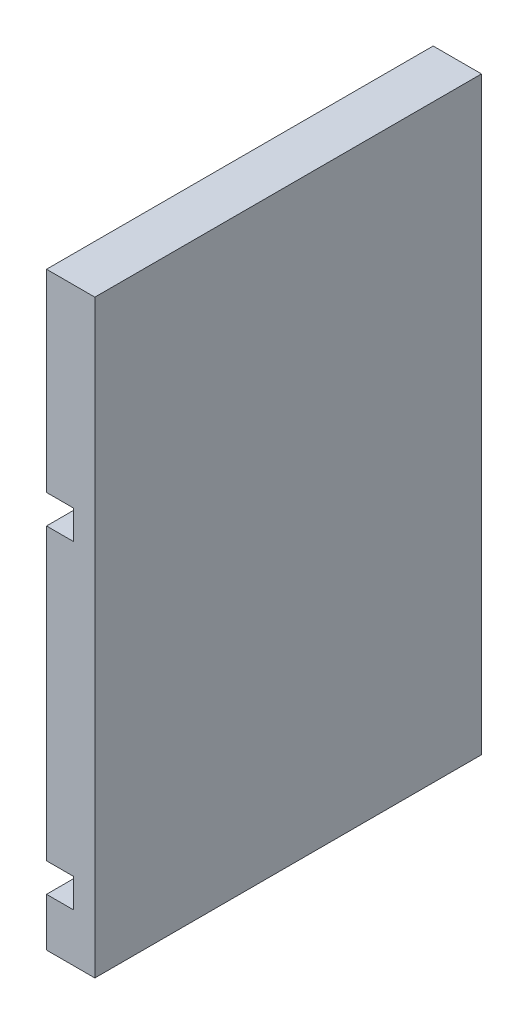
ISO-10303-21;
HEADER;
FILE_DESCRIPTION(('STEP AP214'),'2;1');
FILE_NAME('part.step','',(''),(''),'','','');
FILE_SCHEMA(('AUTOMOTIVE_DESIGN { 1 0 10303 214 1 1 1 1 }'));
ENDSEC;
DATA;
#1=APPLICATION_CONTEXT('core data for automotive mechanical design processes');
#2=APPLICATION_PROTOCOL_DEFINITION('international standard','automotive_design',2000,#1);
#3=PRODUCT_CONTEXT('',#1,'mechanical');
#4=PRODUCT('Part','Part','',(#3));
#5=PRODUCT_RELATED_PRODUCT_CATEGORY('part','',(#4));
#6=PRODUCT_DEFINITION_FORMATION('','',#4);
#7=PRODUCT_DEFINITION_CONTEXT('part definition',#1,'design');
#8=PRODUCT_DEFINITION('design','',#6,#7);
#9=PRODUCT_DEFINITION_SHAPE('','',#8);
#10=(LENGTH_UNIT() NAMED_UNIT(*) SI_UNIT(.MILLI.,.METRE.));
#11=(NAMED_UNIT(*) PLANE_ANGLE_UNIT() SI_UNIT($,.RADIAN.));
#12=(NAMED_UNIT(*) SI_UNIT($,.STERADIAN.) SOLID_ANGLE_UNIT());
#13=UNCERTAINTY_MEASURE_WITH_UNIT(LENGTH_MEASURE(1.E-05),#10,'distance_accuracy_value','');
#14=(GEOMETRIC_REPRESENTATION_CONTEXT(3) GLOBAL_UNCERTAINTY_ASSIGNED_CONTEXT((#13)) GLOBAL_UNIT_ASSIGNED_CONTEXT((#10,
#11,#12)) REPRESENTATION_CONTEXT('',''));
#15=CARTESIAN_POINT('',(0.,0.,0.));
#16=DIRECTION('',(0.,0.,1.));
#17=DIRECTION('',(1.,0.,0.));
#18=AXIS2_PLACEMENT_3D('',#15,#16,#17);
#19=CARTESIAN_POINT('',(0.,30.,40.));
#20=DIRECTION('',(1.,0.,0.));
#21=DIRECTION('',(0.,1.,0.));
#22=AXIS2_PLACEMENT_3D('',#19,#20,#21);
#23=PLANE('',#22);
#24=DIRECTION('',(0.,-1.,0.));
#25=VECTOR('',#24,1.);
#26=CARTESIAN_POINT('',(0.,30.,0.));
#27=LINE('',#26,#25);
#28=CARTESIAN_POINT('',(0.,30.,0.));
#29=VERTEX_POINT('',#28);
#30=CARTESIAN_POINT('',(0.,0.,0.));
#31=VERTEX_POINT('',#30);
#32=EDGE_CURVE('E152',#29,#31,#27,.T.);
#33=ORIENTED_EDGE('',*,*,#32,.T.);
#34=DIRECTION('',(0.,0.,-1.));
#35=VECTOR('',#34,1.);
#36=CARTESIAN_POINT('',(0.,0.,40.));
#37=LINE('',#36,#35);
#38=CARTESIAN_POINT('',(0.,0.,40.));
#39=VERTEX_POINT('',#38);
#40=EDGE_CURVE('E11',#39,#31,#37,.T.);
#41=ORIENTED_EDGE('',*,*,#40,.F.);
#42=DIRECTION('',(0.,-1.,0.));
#43=VECTOR('',#42,1.);
#44=CARTESIAN_POINT('',(0.,30.,40.));
#45=LINE('',#44,#43);
#46=CARTESIAN_POINT('',(0.,30.,40.));
#47=VERTEX_POINT('',#46);
#48=EDGE_CURVE('E174',#47,#39,#45,.T.);
#49=ORIENTED_EDGE('',*,*,#48,.F.);
#50=DIRECTION('',(0.,0.,-1.));
#51=VECTOR('',#50,1.);
#52=CARTESIAN_POINT('',(0.,30.,40.));
#53=LINE('',#52,#51);
#54=EDGE_CURVE('E148',#47,#29,#53,.T.);
#55=ORIENTED_EDGE('',*,*,#54,.T.);
#56=EDGE_LOOP('',(#33,#41,#49,#55));
#57=FACE_BOUND('',#56,.T.);
#58=ADVANCED_FACE('F32',(#57),#23,.F.);
#59=CARTESIAN_POINT('',(2.78764137134926,0.,40.));
#60=DIRECTION('',(0.,1.,0.));
#61=DIRECTION('',(0.,0.,1.));
#62=AXIS2_PLACEMENT_3D('',#59,#60,#61);
#63=PLANE('',#62);
#64=DIRECTION('',(1.,0.,0.));
#65=VECTOR('',#64,1.);
#66=CARTESIAN_POINT('',(2.78764137134926,0.,0.));
#67=LINE('',#66,#65);
#68=CARTESIAN_POINT('',(2.78764137134926,0.,0.));
#69=VERTEX_POINT('',#68);
#70=EDGE_CURVE('E155',#31,#69,#67,.T.);
#71=ORIENTED_EDGE('',*,*,#70,.T.);
#72=DIRECTION('',(0.,0.,-1.));
#73=VECTOR('',#72,1.);
#74=CARTESIAN_POINT('',(2.78764137134926,0.,40.));
#75=LINE('',#74,#73);
#76=CARTESIAN_POINT('',(2.78764137134926,0.,40.));
#77=VERTEX_POINT('',#76);
#78=EDGE_CURVE('E40',#77,#69,#75,.T.);
#79=ORIENTED_EDGE('',*,*,#78,.F.);
#80=DIRECTION('',(1.,0.,0.));
#81=VECTOR('',#80,1.);
#82=CARTESIAN_POINT('',(2.78764137134926,0.,40.));
#83=LINE('',#82,#81);
#84=EDGE_CURVE('E103',#39,#77,#83,.T.);
#85=ORIENTED_EDGE('',*,*,#84,.F.);
#86=ORIENTED_EDGE('',*,*,#40,.T.);
#87=EDGE_LOOP('',(#71,#79,#85,#86));
#88=FACE_BOUND('',#87,.T.);
#89=ADVANCED_FACE('F252',(#88),#63,.F.);
#90=CARTESIAN_POINT('',(2.78764137134926,-3.,40.));
#91=DIRECTION('',(1.,0.,0.));
#92=DIRECTION('',(0.,0.,-1.));
#93=AXIS2_PLACEMENT_3D('',#90,#91,#92);
#94=PLANE('',#93);
#95=DIRECTION('',(0.,-1.,0.));
#96=VECTOR('',#95,1.);
#97=CARTESIAN_POINT('',(2.78764137134926,-3.,0.));
#98=LINE('',#97,#96);
#99=CARTESIAN_POINT('',(2.78764137134926,-3.,0.));
#100=VERTEX_POINT('',#99);
#101=EDGE_CURVE('E157',#69,#100,#98,.T.);
#102=ORIENTED_EDGE('',*,*,#101,.T.);
#103=DIRECTION('',(0.,0.,-1.));
#104=VECTOR('',#103,1.);
#105=CARTESIAN_POINT('',(2.78764137134926,-3.,40.));
#106=LINE('',#105,#104);
#107=CARTESIAN_POINT('',(2.78764137134926,-3.,40.));
#108=VERTEX_POINT('',#107);
#109=EDGE_CURVE('E193',#108,#100,#106,.T.);
#110=ORIENTED_EDGE('',*,*,#109,.F.);
#111=DIRECTION('',(0.,-1.,0.));
#112=VECTOR('',#111,1.);
#113=CARTESIAN_POINT('',(2.78764137134926,-3.,40.));
#114=LINE('',#113,#112);
#115=EDGE_CURVE('E201',#77,#108,#114,.T.);
#116=ORIENTED_EDGE('',*,*,#115,.F.);
#117=ORIENTED_EDGE('',*,*,#78,.T.);
#118=EDGE_LOOP('',(#102,#110,#116,#117));
#119=FACE_BOUND('',#118,.T.);
#120=ADVANCED_FACE('F199',(#119),#94,.F.);
#121=CARTESIAN_POINT('',(0.,-3.,40.));
#122=DIRECTION('',(0.,-1.,0.));
#123=DIRECTION('',(0.,0.,-1.));
#124=AXIS2_PLACEMENT_3D('',#121,#122,#123);
#125=PLANE('',#124);
#126=DIRECTION('',(-1.,0.,0.));
#127=VECTOR('',#126,1.);
#128=CARTESIAN_POINT('',(0.,-3.,0.));
#129=LINE('',#128,#127);
#130=CARTESIAN_POINT('',(0.,-3.,0.));
#131=VERTEX_POINT('',#130);
#132=EDGE_CURVE('E159',#100,#131,#129,.T.);
#133=ORIENTED_EDGE('',*,*,#132,.T.);
#134=DIRECTION('',(0.,0.,-1.));
#135=VECTOR('',#134,1.);
#136=CARTESIAN_POINT('',(0.,-3.,40.));
#137=LINE('',#136,#135);
#138=CARTESIAN_POINT('',(0.,-3.,40.));
#139=VERTEX_POINT('',#138);
#140=EDGE_CURVE('E190',#139,#131,#137,.T.);
#141=ORIENTED_EDGE('',*,*,#140,.F.);
#142=DIRECTION('',(-1.,0.,0.));
#143=VECTOR('',#142,1.);
#144=CARTESIAN_POINT('',(0.,-3.,40.));
#145=LINE('',#144,#143);
#146=EDGE_CURVE('E219',#108,#139,#145,.T.);
#147=ORIENTED_EDGE('',*,*,#146,.F.);
#148=ORIENTED_EDGE('',*,*,#109,.T.);
#149=EDGE_LOOP('',(#133,#141,#147,#148));
#150=FACE_BOUND('',#149,.T.);
#151=ADVANCED_FACE('F210',(#150),#125,.F.);
#152=CARTESIAN_POINT('',(0.,-8.,40.));
#153=DIRECTION('',(1.,0.,0.));
#154=DIRECTION('',(0.,0.,-1.));
#155=AXIS2_PLACEMENT_3D('',#152,#153,#154);
#156=PLANE('',#155);
#157=DIRECTION('',(0.,-1.,0.));
#158=VECTOR('',#157,1.);
#159=CARTESIAN_POINT('',(0.,-8.,0.));
#160=LINE('',#159,#158);
#161=CARTESIAN_POINT('',(0.,-8.,0.));
#162=VERTEX_POINT('',#161);
#163=EDGE_CURVE('E161',#131,#162,#160,.T.);
#164=ORIENTED_EDGE('',*,*,#163,.T.);
#165=DIRECTION('',(0.,0.,-1.));
#166=VECTOR('',#165,1.);
#167=CARTESIAN_POINT('',(0.,-8.,40.));
#168=LINE('',#167,#166);
#169=CARTESIAN_POINT('',(0.,-8.,40.));
#170=VERTEX_POINT('',#169);
#171=EDGE_CURVE('E187',#170,#162,#168,.T.);
#172=ORIENTED_EDGE('',*,*,#171,.F.);
#173=DIRECTION('',(0.,-1.,0.));
#174=VECTOR('',#173,1.);
#175=CARTESIAN_POINT('',(0.,-8.,40.));
#176=LINE('',#175,#174);
#177=EDGE_CURVE('E216',#139,#170,#176,.T.);
#178=ORIENTED_EDGE('',*,*,#177,.F.);
#179=ORIENTED_EDGE('',*,*,#140,.T.);
#180=EDGE_LOOP('',(#164,#172,#178,#179));
#181=FACE_BOUND('',#180,.T.);
#182=ADVANCED_FACE('F214',(#181),#156,.F.);
#183=CARTESIAN_POINT('',(5.,-8.,40.));
#184=DIRECTION('',(0.,1.,0.));
#185=DIRECTION('',(0.,0.,1.));
#186=AXIS2_PLACEMENT_3D('',#183,#184,#185);
#187=PLANE('',#186);
#188=DIRECTION('',(1.,0.,0.));
#189=VECTOR('',#188,1.);
#190=CARTESIAN_POINT('',(5.,-8.,0.));
#191=LINE('',#190,#189);
#192=CARTESIAN_POINT('',(5.,-8.,0.));
#193=VERTEX_POINT('',#192);
#194=EDGE_CURVE('E163',#162,#193,#191,.T.);
#195=ORIENTED_EDGE('',*,*,#194,.T.);
#196=DIRECTION('',(0.,0.,-1.));
#197=VECTOR('',#196,1.);
#198=CARTESIAN_POINT('',(5.,-8.,40.));
#199=LINE('',#198,#197);
#200=CARTESIAN_POINT('',(5.,-8.,40.));
#201=VERTEX_POINT('',#200);
#202=EDGE_CURVE('E184',#201,#193,#199,.T.);
#203=ORIENTED_EDGE('',*,*,#202,.F.);
#204=DIRECTION('',(1.,0.,0.));
#205=VECTOR('',#204,1.);
#206=CARTESIAN_POINT('',(5.,-8.,40.));
#207=LINE('',#206,#205);
#208=EDGE_CURVE('E218',#170,#201,#207,.T.);
#209=ORIENTED_EDGE('',*,*,#208,.F.);
#210=ORIENTED_EDGE('',*,*,#171,.T.);
#211=EDGE_LOOP('',(#195,#203,#209,#210));
#212=FACE_BOUND('',#211,.T.);
#213=ADVANCED_FACE('F265',(#212),#187,.F.);
#214=CARTESIAN_POINT('',(4.99999999999999,53.,40.));
#215=DIRECTION('',(-1.,0.,0.));
#216=DIRECTION('',(0.,-1.,0.));
#217=AXIS2_PLACEMENT_3D('',#214,#215,#216);
#218=PLANE('',#217);
#219=DIRECTION('',(0.,1.,0.));
#220=VECTOR('',#219,1.);
#221=CARTESIAN_POINT('',(4.99999999999999,53.,0.));
#222=LINE('',#221,#220);
#223=CARTESIAN_POINT('',(4.99999999999999,53.,0.));
#224=VERTEX_POINT('',#223);
#225=EDGE_CURVE('E165',#193,#224,#222,.T.);
#226=ORIENTED_EDGE('',*,*,#225,.T.);
#227=DIRECTION('',(0.,0.,-1.));
#228=VECTOR('',#227,1.);
#229=CARTESIAN_POINT('',(4.99999999999999,53.,40.));
#230=LINE('',#229,#228);
#231=CARTESIAN_POINT('',(4.99999999999999,53.,40.));
#232=VERTEX_POINT('',#231);
#233=EDGE_CURVE('E181',#232,#224,#230,.T.);
#234=ORIENTED_EDGE('',*,*,#233,.F.);
#235=DIRECTION('',(0.,1.,0.));
#236=VECTOR('',#235,1.);
#237=CARTESIAN_POINT('',(4.99999999999999,53.,40.));
#238=LINE('',#237,#236);
#239=EDGE_CURVE('E221',#201,#232,#238,.T.);
#240=ORIENTED_EDGE('',*,*,#239,.F.);
#241=ORIENTED_EDGE('',*,*,#202,.T.);
#242=EDGE_LOOP('',(#226,#234,#240,#241));
#243=FACE_BOUND('',#242,.T.);
#244=ADVANCED_FACE('F268',(#243),#218,.F.);
#245=CARTESIAN_POINT('',(0.,53.,40.));
#246=DIRECTION('',(0.,-1.,0.));
#247=DIRECTION('',(0.,0.,-1.));
#248=AXIS2_PLACEMENT_3D('',#245,#246,#247);
#249=PLANE('',#248);
#250=DIRECTION('',(-1.,0.,0.));
#251=VECTOR('',#250,1.);
#252=CARTESIAN_POINT('',(0.,53.,0.));
#253=LINE('',#252,#251);
#254=CARTESIAN_POINT('',(0.,53.,0.));
#255=VERTEX_POINT('',#254);
#256=EDGE_CURVE('E167',#224,#255,#253,.T.);
#257=ORIENTED_EDGE('',*,*,#256,.T.);
#258=DIRECTION('',(0.,0.,-1.));
#259=VECTOR('',#258,1.);
#260=CARTESIAN_POINT('',(0.,53.,40.));
#261=LINE('',#260,#259);
#262=CARTESIAN_POINT('',(0.,53.,40.));
#263=VERTEX_POINT('',#262);
#264=EDGE_CURVE('E178',#263,#255,#261,.T.);
#265=ORIENTED_EDGE('',*,*,#264,.F.);
#266=DIRECTION('',(-1.,0.,0.));
#267=VECTOR('',#266,1.);
#268=CARTESIAN_POINT('',(0.,53.,40.));
#269=LINE('',#268,#267);
#270=EDGE_CURVE('E227',#232,#263,#269,.T.);
#271=ORIENTED_EDGE('',*,*,#270,.F.);
#272=ORIENTED_EDGE('',*,*,#233,.T.);
#273=EDGE_LOOP('',(#257,#265,#271,#272));
#274=FACE_BOUND('',#273,.T.);
#275=ADVANCED_FACE('F233',(#274),#249,.F.);
#276=CARTESIAN_POINT('',(0.,53.,40.));
#277=DIRECTION('',(1.,0.,0.));
#278=DIRECTION('',(0.,1.,0.));
#279=AXIS2_PLACEMENT_3D('',#276,#277,#278);
#280=PLANE('',#279);
#281=DIRECTION('',(0.,-1.,0.));
#282=VECTOR('',#281,1.);
#283=CARTESIAN_POINT('',(0.,53.,0.));
#284=LINE('',#283,#282);
#285=CARTESIAN_POINT('',(0.,33.,0.));
#286=VERTEX_POINT('',#285);
#287=EDGE_CURVE('E169',#255,#286,#284,.T.);
#288=ORIENTED_EDGE('',*,*,#287,.T.);
#289=DIRECTION('',(0.,0.,-1.));
#290=VECTOR('',#289,1.);
#291=CARTESIAN_POINT('',(0.,33.,40.));
#292=LINE('',#291,#290);
#293=CARTESIAN_POINT('',(0.,33.,40.));
#294=VERTEX_POINT('',#293);
#295=EDGE_CURVE('E143',#294,#286,#292,.T.);
#296=ORIENTED_EDGE('',*,*,#295,.F.);
#297=DIRECTION('',(0.,-1.,0.));
#298=VECTOR('',#297,1.);
#299=CARTESIAN_POINT('',(0.,53.,40.));
#300=LINE('',#299,#298);
#301=EDGE_CURVE('E134',#263,#294,#300,.T.);
#302=ORIENTED_EDGE('',*,*,#301,.F.);
#303=ORIENTED_EDGE('',*,*,#264,.T.);
#304=EDGE_LOOP('',(#288,#296,#302,#303));
#305=FACE_BOUND('',#304,.T.);
#306=ADVANCED_FACE('F237',(#305),#280,.F.);
#307=CARTESIAN_POINT('',(0.,33.,40.));
#308=DIRECTION('',(0.,1.,0.));
#309=DIRECTION('',(0.,0.,1.));
#310=AXIS2_PLACEMENT_3D('',#307,#308,#309);
#311=PLANE('',#310);
#312=DIRECTION('',(1.,0.,0.));
#313=VECTOR('',#312,1.);
#314=CARTESIAN_POINT('',(0.,33.,0.));
#315=LINE('',#314,#313);
#316=CARTESIAN_POINT('',(2.78764137134926,33.,0.));
#317=VERTEX_POINT('',#316);
#318=EDGE_CURVE('E142',#286,#317,#315,.T.);
#319=ORIENTED_EDGE('',*,*,#318,.T.);
#320=DIRECTION('',(0.,0.,-1.));
#321=VECTOR('',#320,1.);
#322=CARTESIAN_POINT('',(2.78764137134926,33.,40.));
#323=LINE('',#322,#321);
#324=CARTESIAN_POINT('',(2.78764137134926,33.,40.));
#325=VERTEX_POINT('',#324);
#326=EDGE_CURVE('E139',#325,#317,#323,.T.);
#327=ORIENTED_EDGE('',*,*,#326,.F.);
#328=DIRECTION('',(1.,0.,0.));
#329=VECTOR('',#328,1.);
#330=CARTESIAN_POINT('',(0.,33.,40.));
#331=LINE('',#330,#329);
#332=EDGE_CURVE('E128',#294,#325,#331,.T.);
#333=ORIENTED_EDGE('',*,*,#332,.F.);
#334=ORIENTED_EDGE('',*,*,#295,.T.);
#335=EDGE_LOOP('',(#319,#327,#333,#334));
#336=FACE_BOUND('',#335,.T.);
#337=ADVANCED_FACE('F140',(#336),#311,.F.);
#338=CARTESIAN_POINT('',(2.78764137134926,33.,40.));
#339=DIRECTION('',(1.,0.,0.));
#340=DIRECTION('',(0.,1.,0.));
#341=AXIS2_PLACEMENT_3D('',#338,#339,#340);
#342=PLANE('',#341);
#343=DIRECTION('',(0.,-1.,0.));
#344=VECTOR('',#343,1.);
#345=CARTESIAN_POINT('',(2.78764137134926,33.,0.));
#346=LINE('',#345,#344);
#347=CARTESIAN_POINT('',(2.78764137134926,30.,0.));
#348=VERTEX_POINT('',#347);
#349=EDGE_CURVE('E89',#317,#348,#346,.T.);
#350=ORIENTED_EDGE('',*,*,#349,.T.);
#351=DIRECTION('',(0.,0.,-1.));
#352=VECTOR('',#351,1.);
#353=CARTESIAN_POINT('',(2.78764137134926,30.,40.));
#354=LINE('',#353,#352);
#355=CARTESIAN_POINT('',(2.78764137134926,30.,40.));
#356=VERTEX_POINT('',#355);
#357=EDGE_CURVE('E144',#356,#348,#354,.T.);
#358=ORIENTED_EDGE('',*,*,#357,.F.);
#359=DIRECTION('',(0.,-1.,0.));
#360=VECTOR('',#359,1.);
#361=CARTESIAN_POINT('',(2.78764137134926,33.,40.));
#362=LINE('',#361,#360);
#363=EDGE_CURVE('E132',#325,#356,#362,.T.);
#364=ORIENTED_EDGE('',*,*,#363,.F.);
#365=ORIENTED_EDGE('',*,*,#326,.T.);
#366=EDGE_LOOP('',(#350,#358,#364,#365));
#367=FACE_BOUND('',#366,.T.);
#368=ADVANCED_FACE('F146',(#367),#342,.F.);
#369=CARTESIAN_POINT('',(2.78764137134926,30.,40.));
#370=DIRECTION('',(0.,-1.,0.));
#371=DIRECTION('',(0.,0.,-1.));
#372=AXIS2_PLACEMENT_3D('',#369,#370,#371);
#373=PLANE('',#372);
#374=DIRECTION('',(-1.,0.,0.));
#375=VECTOR('',#374,1.);
#376=CARTESIAN_POINT('',(2.78764137134926,30.,0.));
#377=LINE('',#376,#375);
#378=EDGE_CURVE('E95',#348,#29,#377,.T.);
#379=ORIENTED_EDGE('',*,*,#378,.T.);
#380=ORIENTED_EDGE('',*,*,#54,.F.);
#381=DIRECTION('',(-1.,0.,0.));
#382=VECTOR('',#381,1.);
#383=CARTESIAN_POINT('',(2.78764137134926,30.,40.));
#384=LINE('',#383,#382);
#385=EDGE_CURVE('E48',#356,#47,#384,.T.);
#386=ORIENTED_EDGE('',*,*,#385,.F.);
#387=ORIENTED_EDGE('',*,*,#357,.T.);
#388=EDGE_LOOP('',(#379,#380,#386,#387));
#389=FACE_BOUND('',#388,.T.);
#390=ADVANCED_FACE('F241',(#389),#373,.F.);
#391=CARTESIAN_POINT('',(0.,0.,40.));
#392=DIRECTION('',(0.,0.,-1.));
#393=DIRECTION('',(-1.,0.,0.));
#394=AXIS2_PLACEMENT_3D('',#391,#392,#393);
#395=PLANE('',#394);
#396=ORIENTED_EDGE('',*,*,#48,.T.);
#397=ORIENTED_EDGE('',*,*,#84,.T.);
#398=ORIENTED_EDGE('',*,*,#115,.T.);
#399=ORIENTED_EDGE('',*,*,#146,.T.);
#400=ORIENTED_EDGE('',*,*,#177,.T.);
#401=ORIENTED_EDGE('',*,*,#208,.T.);
#402=ORIENTED_EDGE('',*,*,#239,.T.);
#403=ORIENTED_EDGE('',*,*,#270,.T.);
#404=ORIENTED_EDGE('',*,*,#301,.T.);
#405=ORIENTED_EDGE('',*,*,#332,.T.);
#406=ORIENTED_EDGE('',*,*,#363,.T.);
#407=ORIENTED_EDGE('',*,*,#385,.T.);
#408=EDGE_LOOP('',(#396,#397,#398,#399,#400,#401,#402,#403,#404,#405,#406,#407));
#409=FACE_BOUND('',#408,.T.);
#410=ADVANCED_FACE('F130',(#409),#395,.F.);
#411=CARTESIAN_POINT('',(0.,0.,0.));
#412=DIRECTION('',(0.,0.,-1.));
#413=DIRECTION('',(-1.,0.,0.));
#414=AXIS2_PLACEMENT_3D('',#411,#412,#413);
#415=PLANE('',#414);
#416=ORIENTED_EDGE('',*,*,#32,.F.);
#417=ORIENTED_EDGE('',*,*,#378,.F.);
#418=ORIENTED_EDGE('',*,*,#349,.F.);
#419=ORIENTED_EDGE('',*,*,#318,.F.);
#420=ORIENTED_EDGE('',*,*,#287,.F.);
#421=ORIENTED_EDGE('',*,*,#256,.F.);
#422=ORIENTED_EDGE('',*,*,#225,.F.);
#423=ORIENTED_EDGE('',*,*,#194,.F.);
#424=ORIENTED_EDGE('',*,*,#163,.F.);
#425=ORIENTED_EDGE('',*,*,#132,.F.);
#426=ORIENTED_EDGE('',*,*,#101,.F.);
#427=ORIENTED_EDGE('',*,*,#70,.F.);
#428=EDGE_LOOP('',(#416,#417,#418,#419,#420,#421,#422,#423,#424,#425,#426,#427));
#429=FACE_BOUND('',#428,.T.);
#430=ADVANCED_FACE('F205',(#429),#415,.T.);
#431=CLOSED_SHELL('',(#58,#89,#120,#151,#182,#213,#244,#275,#306,#337,#368,#390,#410,#430));
#432=MANIFOLD_SOLID_BREP('B2',#431);
#433=ADVANCED_BREP_SHAPE_REPRESENTATION('',(#18,#432),#14);
#434=SHAPE_DEFINITION_REPRESENTATION(#9,#433);
ENDSEC;
END-ISO-10303-21;
